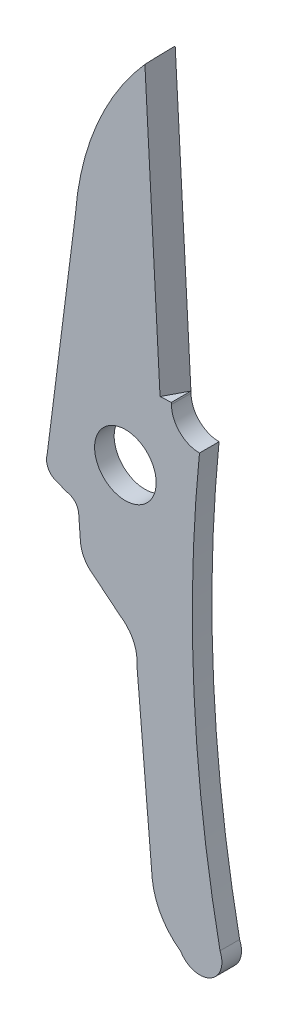
ISO-10303-21;
HEADER;
FILE_DESCRIPTION(('STEP AP214'),'2;1');
FILE_NAME('part.step','',(''),(''),'','','');
FILE_SCHEMA(('AUTOMOTIVE_DESIGN { 1 0 10303 214 1 1 1 1 }'));
ENDSEC;
DATA;
#1=APPLICATION_CONTEXT('core data for automotive mechanical design processes');
#2=APPLICATION_PROTOCOL_DEFINITION('international standard','automotive_design',2000,#1);
#3=PRODUCT_CONTEXT('',#1,'mechanical');
#4=PRODUCT('Part','Part','',(#3));
#5=PRODUCT_RELATED_PRODUCT_CATEGORY('part','',(#4));
#6=PRODUCT_DEFINITION_FORMATION('','',#4);
#7=PRODUCT_DEFINITION_CONTEXT('part definition',#1,'design');
#8=PRODUCT_DEFINITION('design','',#6,#7);
#9=PRODUCT_DEFINITION_SHAPE('','',#8);
#10=(LENGTH_UNIT() NAMED_UNIT(*) SI_UNIT(.MILLI.,.METRE.));
#11=(NAMED_UNIT(*) PLANE_ANGLE_UNIT() SI_UNIT($,.RADIAN.));
#12=(NAMED_UNIT(*) SI_UNIT($,.STERADIAN.) SOLID_ANGLE_UNIT());
#13=UNCERTAINTY_MEASURE_WITH_UNIT(LENGTH_MEASURE(1.E-05),#10,'distance_accuracy_value','');
#14=(GEOMETRIC_REPRESENTATION_CONTEXT(3) GLOBAL_UNCERTAINTY_ASSIGNED_CONTEXT((#13)) GLOBAL_UNIT_ASSIGNED_CONTEXT((#10,
#11,#12)) REPRESENTATION_CONTEXT('',''));
#15=CARTESIAN_POINT('',(0.,0.,0.));
#16=DIRECTION('',(0.,0.,1.));
#17=DIRECTION('',(1.,0.,0.));
#18=AXIS2_PLACEMENT_3D('',#15,#16,#17);
#19=CARTESIAN_POINT('',(8.87535022084032,21.3967215415515,0.4445));
#20=DIRECTION('',(-0.998541027193039,-0.0539983056425618,0.));
#21=DIRECTION('',(0.0539983056425618,-0.998541027193039,0.));
#22=AXIS2_PLACEMENT_3D('',#19,#20,#21);
#23=PLANE('',#22);
#24=DIRECTION('',(0.,0.,-0.999999999999999));
#25=VECTOR('',#24,1.);
#26=CARTESIAN_POINT('',(9.5891248490089,8.19754349486115,-0.444499999999999));
#27=LINE('',#26,#25);
#28=CARTESIAN_POINT('',(9.5891248490089,8.19754349486114,0.4445));
#29=VERTEX_POINT('',#28);
#30=CARTESIAN_POINT('',(9.5891248490089,8.19754349486115,-0.444499999999999));
#31=VERTEX_POINT('',#30);
#32=EDGE_CURVE('E352',#29,#31,#27,.T.);
#33=ORIENTED_EDGE('',*,*,#32,.F.);
#34=DIRECTION('',(-0.0539983056425619,0.998541027193039,0.));
#35=VECTOR('',#34,1.);
#36=CARTESIAN_POINT('',(8.87535022084032,21.3967215415515,0.4445));
#37=LINE('',#36,#35);
#38=CARTESIAN_POINT('',(9.59345121249939,8.11754003193003,0.4445));
#39=VERTEX_POINT('',#38);
#40=EDGE_CURVE('E199',#39,#29,#37,.T.);
#41=ORIENTED_EDGE('',*,*,#40,.F.);
#42=DIRECTION('',(0.,0.,-0.999999999999999));
#43=VECTOR('',#42,1.);
#44=CARTESIAN_POINT('',(9.59345121249939,8.11754003193003,0.4445));
#45=LINE('',#44,#43);
#46=CARTESIAN_POINT('',(9.59345121249939,8.11754003193003,-0.444499999999999));
#47=VERTEX_POINT('',#46);
#48=EDGE_CURVE('E205',#39,#47,#45,.T.);
#49=ORIENTED_EDGE('',*,*,#48,.T.);
#50=DIRECTION('',(-0.0539983056425619,0.998541027193039,0.));
#51=VECTOR('',#50,1.);
#52=CARTESIAN_POINT('',(8.87535022084032,21.3967215415515,-0.444499999999999));
#53=LINE('',#52,#51);
#54=EDGE_CURVE('E248',#47,#31,#53,.T.);
#55=ORIENTED_EDGE('',*,*,#54,.T.);
#56=EDGE_LOOP('',(#33,#41,#49,#55));
#57=FACE_BOUND('',#56,.T.);
#58=ADVANCED_FACE('F52',(#57),#23,.F.);
#59=CARTESIAN_POINT('',(17.8999944526905,12.4660316361044,0.444499999999998));
#60=DIRECTION('',(0.,0.,0.999999999999999));
#61=DIRECTION('',(0.999999999999999,0.,0.));
#62=AXIS2_PLACEMENT_3D('',#59,#60,#61);
#63=PLANE('',#62);
#64=DIRECTION('',(-0.0539983056425618,0.998541027193039,0.));
#65=VECTOR('',#64,1.);
#66=CARTESIAN_POINT('',(9.07660929848611,8.16982808749175,0.4445));
#67=LINE('',#66,#65);
#68=CARTESIAN_POINT('',(9.07660929848611,8.16982808749175,0.4445));
#69=VERTEX_POINT('',#68);
#70=CARTESIAN_POINT('',(8.38942156859265,20.8773590649342,0.4445));
#71=VERTEX_POINT('',#70);
#72=EDGE_CURVE('E356',#69,#71,#67,.T.);
#73=ORIENTED_EDGE('',*,*,#72,.T.);
#74=CARTESIAN_POINT('',(17.8999944526905,12.4660316361044,0.444499999999998));
#75=DIRECTION('',(0.,0.,0.999999999999999));
#76=DIRECTION('',(0.999999999999999,0.,0.));
#77=AXIS2_PLACEMENT_3D('',#74,#75,#76);
#78=CIRCLE('',#77,12.6965123438967);
#79=CARTESIAN_POINT('',(5.24165207504561,13.4497968260968,0.4445));
#80=VERTEX_POINT('',#79);
#81=EDGE_CURVE('E136',#71,#80,#78,.T.);
#82=ORIENTED_EDGE('',*,*,#81,.T.);
#83=DIRECTION('',(-0.126205814413959,-0.992004078826346,0.));
#84=VECTOR('',#83,1.);
#85=CARTESIAN_POINT('',(5.24165207504561,13.4497968260968,0.4445));
#86=LINE('',#85,#84);
#87=CARTESIAN_POINT('',(3.95193941346692,3.31238575085468,0.4445));
#88=VERTEX_POINT('',#87);
#89=EDGE_CURVE('E386',#80,#88,#86,.T.);
#90=ORIENTED_EDGE('',*,*,#89,.T.);
#91=CARTESIAN_POINT('',(4.60696106937597,3.12523670630922,0.4445));
#92=DIRECTION('',(0.,0.,0.999999999999999));
#93=DIRECTION('',(0.999999999999999,0.,0.));
#94=AXIS2_PLACEMENT_3D('',#91,#92,#93);
#95=CIRCLE('',#94,0.681232804982338);
#96=CARTESIAN_POINT('',(4.41981202483053,2.47021505040017,0.4445));
#97=VERTEX_POINT('',#96);
#98=EDGE_CURVE('E297',#88,#97,#95,.T.);
#99=ORIENTED_EDGE('',*,*,#98,.T.);
#100=DIRECTION('',(0.937211368547196,-0.348761882472684,0.));
#101=VECTOR('',#100,1.);
#102=CARTESIAN_POINT('',(4.41981202483053,2.47021505040017,0.4445));
#103=LINE('',#102,#101);
#104=CARTESIAN_POINT('',(4.86832905617347,2.30330964418993,0.4445));
#105=VERTEX_POINT('',#104);
#106=EDGE_CURVE('E318',#97,#105,#103,.T.);
#107=ORIENTED_EDGE('',*,*,#106,.T.);
#108=CARTESIAN_POINT('',(4.75492122023925,1.67956654655184,0.4445));
#109=DIRECTION('',(0.,0.,-0.999999999999999));
#110=DIRECTION('',(-0.999999999999999,0.,0.));
#111=AXIS2_PLACEMENT_3D('',#108,#109,#110);
#112=CIRCLE('',#111,0.633969075825059);
#113=CARTESIAN_POINT('',(5.38889029606433,1.67956654655181,0.4445));
#114=VERTEX_POINT('',#113);
#115=EDGE_CURVE('E314',#105,#114,#112,.T.);
#116=ORIENTED_EDGE('',*,*,#115,.T.);
#117=DIRECTION('',(0.0754676674730975,-0.997148249342177,0.));
#118=VECTOR('',#117,1.);
#119=CARTESIAN_POINT('',(5.38889029606433,1.67956654655181,0.4445));
#120=LINE('',#119,#118);
#121=CARTESIAN_POINT('',(5.46181354816631,0.71603745383457,0.4445));
#122=VERTEX_POINT('',#121);
#123=EDGE_CURVE('E317',#114,#122,#120,.T.);
#124=ORIENTED_EDGE('',*,*,#123,.T.);
#125=CARTESIAN_POINT('',(6.83340609101111,0.773736504708036,0.4445));
#126=DIRECTION('',(0.,0.,0.999999999999999));
#127=DIRECTION('',(0.999999999999999,0.,0.));
#128=AXIS2_PLACEMENT_3D('',#125,#126,#127);
#129=CIRCLE('',#128,1.37280562501);
#130=CARTESIAN_POINT('',(6.06544384930026,-0.364169150153394,0.4445));
#131=VERTEX_POINT('',#130);
#132=EDGE_CURVE('E322',#122,#131,#129,.T.);
#133=ORIENTED_EDGE('',*,*,#132,.T.);
#134=DIRECTION('',(0.774450200248872,-0.632634876792672,0.));
#135=VECTOR('',#134,1.);
#136=CARTESIAN_POINT('',(6.06544384930026,-0.364169150153394,0.4445));
#137=LINE('',#136,#135);
#138=CARTESIAN_POINT('',(7.25790350826133,-1.33826867157472,0.4445));
#139=VERTEX_POINT('',#138);
#140=EDGE_CURVE('E329',#131,#139,#137,.T.);
#141=ORIENTED_EDGE('',*,*,#140,.T.);
#142=CARTESIAN_POINT('',(6.33508466458808,-2.76465930276469,0.4445));
#143=DIRECTION('',(0.,0.,-0.999999999999999));
#144=DIRECTION('',(0.999999999999999,0.,0.));
#145=AXIS2_PLACEMENT_3D('',#142,#143,#144);
#146=CIRCLE('',#145,1.69887752677614);
#147=CARTESIAN_POINT('',(8.02755801292326,-2.91203235376181,0.4445));
#148=VERTEX_POINT('',#147);
#149=EDGE_CURVE('E332',#139,#148,#146,.T.);
#150=ORIENTED_EDGE('',*,*,#149,.T.);
#151=DIRECTION('',(0.0860585561033904,-0.99629008071013,0.));
#152=VECTOR('',#151,1.);
#153=CARTESIAN_POINT('',(8.02755801292326,-2.91203235376181,0.4445));
#154=LINE('',#153,#152);
#155=CARTESIAN_POINT('',(8.72184815461192,-10.949750073174,0.4445));
#156=VERTEX_POINT('',#155);
#157=EDGE_CURVE('E335',#148,#156,#154,.T.);
#158=ORIENTED_EDGE('',*,*,#157,.T.);
#159=CARTESIAN_POINT('',(11.8017984871232,-10.6294725170538,0.4445));
#160=DIRECTION('',(0.,0.,0.999999999999999));
#161=DIRECTION('',(-0.999999999999999,0.,0.));
#162=AXIS2_PLACEMENT_3D('',#159,#160,#161);
#163=CIRCLE('',#162,3.09655805107718);
#164=CARTESIAN_POINT('',(10.0143827284991,-13.1580722618756,0.4445));
#165=VERTEX_POINT('',#164);
#166=EDGE_CURVE('E178',#156,#165,#163,.T.);
#167=ORIENTED_EDGE('',*,*,#166,.T.);
#168=CARTESIAN_POINT('',(10.8801357104957,-12.651345631404,0.4445));
#169=DIRECTION('',(0.,0.,0.999999999999999));
#170=DIRECTION('',(-0.999999999999999,0.,0.));
#171=AXIS2_PLACEMENT_3D('',#168,#169,#170);
#172=CIRCLE('',#171,1.00314510608632);
#173=CARTESIAN_POINT('',(11.7971836730414,-12.2447461500275,0.4445));
#174=VERTEX_POINT('',#173);
#175=EDGE_CURVE('E170',#165,#174,#172,.T.);
#176=ORIENTED_EDGE('',*,*,#175,.T.);
#177=CARTESIAN_POINT('',(74.7934735787826,0.400508130629064,0.4445));
#178=DIRECTION('',(0.,0.,-0.999999999999999));
#179=DIRECTION('',(0.999999999999999,0.,0.));
#180=AXIS2_PLACEMENT_3D('',#177,#178,#179);
#181=CIRCLE('',#180,64.252898749478);
#182=CARTESIAN_POINT('',(10.864708621915,6.8462826225144,0.4445));
#183=VERTEX_POINT('',#182);
#184=EDGE_CURVE('E175',#174,#183,#181,.T.);
#185=ORIENTED_EDGE('',*,*,#184,.T.);
#186=CARTESIAN_POINT('',(10.864708621915,8.11754003193003,0.4445));
#187=DIRECTION('',(0.,0.,-0.999999999999999));
#188=DIRECTION('',(0.999999999999999,0.,0.));
#189=AXIS2_PLACEMENT_3D('',#186,#187,#188);
#190=CIRCLE('',#189,1.27125740941564);
#191=EDGE_CURVE('E77',#183,#39,#190,.T.);
#192=ORIENTED_EDGE('',*,*,#191,.T.);
#193=ORIENTED_EDGE('',*,*,#40,.T.);
#194=DIRECTION('',(0.998541027193039,0.0539983056425644,0.));
#195=VECTOR('',#194,1.);
#196=CARTESIAN_POINT('',(9.5891248490089,8.19754349486115,0.4445));
#197=LINE('',#196,#195);
#198=EDGE_CURVE('E68',#69,#29,#197,.T.);
#199=ORIENTED_EDGE('',*,*,#198,.F.);
#200=EDGE_LOOP('',(#73,#82,#90,#99,#107,#116,#124,#133,#141,#150,#158,#167,#176,#185,#192,#193,#199));
#201=FACE_BOUND('',#200,.T.);
#202=CARTESIAN_POINT('',(7.50395075121722,4.69075725159076,0.4445));
#203=DIRECTION('',(0.,0.,0.999999999999999));
#204=DIRECTION('',(0.999999999999999,0.,0.));
#205=AXIS2_PLACEMENT_3D('',#202,#203,#204);
#206=CIRCLE('',#205,1.397);
#207=CARTESIAN_POINT('',(8.90095075121722,4.69075725159076,0.4445));
#208=VERTEX_POINT('',#207);
#209=EDGE_CURVE('E211',#208,#208,#206,.T.);
#210=ORIENTED_EDGE('',*,*,#209,.F.);
#211=EDGE_LOOP('',(#210));
#212=FACE_BOUND('',#211,.T.);
#213=ADVANCED_FACE('F172',(#201,#212),#63,.T.);
#214=CARTESIAN_POINT('',(17.8999944526905,12.4660316361044,-0.4445));
#215=DIRECTION('',(0.,0.,0.999999999999999));
#216=DIRECTION('',(0.999999999999999,0.,0.));
#217=AXIS2_PLACEMENT_3D('',#214,#215,#216);
#218=PLANE('',#217);
#219=CARTESIAN_POINT('',(17.8999944526905,12.4660316361044,-0.4445));
#220=DIRECTION('',(0.,0.,0.999999999999999));
#221=DIRECTION('',(0.999999999999999,0.,0.));
#222=AXIS2_PLACEMENT_3D('',#219,#220,#221);
#223=CIRCLE('',#222,12.6965123438967);
#224=CARTESIAN_POINT('',(8.87535022084032,21.3967215415515,-0.444499999999999));
#225=VERTEX_POINT('',#224);
#226=CARTESIAN_POINT('',(5.24165207504561,13.4497968260968,-0.4445));
#227=VERTEX_POINT('',#226);
#228=EDGE_CURVE('E206',#225,#227,#223,.T.);
#229=ORIENTED_EDGE('',*,*,#228,.F.);
#230=DIRECTION('',(-0.0539983056425618,0.998541027193039,0.));
#231=VECTOR('',#230,1.);
#232=CARTESIAN_POINT('',(9.5891248490089,8.19754349486115,-0.444499999999999));
#233=LINE('',#232,#231);
#234=EDGE_CURVE('E367',#31,#225,#233,.T.);
#235=ORIENTED_EDGE('',*,*,#234,.F.);
#236=ORIENTED_EDGE('',*,*,#54,.F.);
#237=CARTESIAN_POINT('',(10.864708621915,8.11754003193003,-0.444499999999999));
#238=DIRECTION('',(0.,0.,-0.999999999999999));
#239=DIRECTION('',(0.999999999999999,0.,0.));
#240=AXIS2_PLACEMENT_3D('',#237,#238,#239);
#241=CIRCLE('',#240,1.27125740941564);
#242=CARTESIAN_POINT('',(10.864708621915,6.8462826225144,-0.444499999999999));
#243=VERTEX_POINT('',#242);
#244=EDGE_CURVE('E128',#243,#47,#241,.T.);
#245=ORIENTED_EDGE('',*,*,#244,.F.);
#246=CARTESIAN_POINT('',(74.7934735787826,0.400508130629064,-0.444499999999999));
#247=DIRECTION('',(0.,0.,-0.999999999999999));
#248=DIRECTION('',(0.999999999999999,0.,0.));
#249=AXIS2_PLACEMENT_3D('',#246,#247,#248);
#250=CIRCLE('',#249,64.252898749478);
#251=CARTESIAN_POINT('',(11.7971836730414,-12.2447461500275,-0.444499999999999));
#252=VERTEX_POINT('',#251);
#253=EDGE_CURVE('E243',#252,#243,#250,.T.);
#254=ORIENTED_EDGE('',*,*,#253,.F.);
#255=CARTESIAN_POINT('',(10.8801357104957,-12.651345631404,-0.444499999999999));
#256=DIRECTION('',(0.,0.,0.999999999999999));
#257=DIRECTION('',(-0.999999999999999,0.,0.));
#258=AXIS2_PLACEMENT_3D('',#255,#256,#257);
#259=CIRCLE('',#258,1.00314510608632);
#260=CARTESIAN_POINT('',(10.0143827284991,-13.1580722618756,-0.444499999999999));
#261=VERTEX_POINT('',#260);
#262=EDGE_CURVE('E188',#261,#252,#259,.T.);
#263=ORIENTED_EDGE('',*,*,#262,.F.);
#264=CARTESIAN_POINT('',(11.8017984871232,-10.6294725170538,-0.444499999999999));
#265=DIRECTION('',(0.,0.,0.999999999999999));
#266=DIRECTION('',(-0.999999999999999,0.,0.));
#267=AXIS2_PLACEMENT_3D('',#264,#265,#266);
#268=CIRCLE('',#267,3.09655805107718);
#269=CARTESIAN_POINT('',(8.72184815461192,-10.949750073174,-0.4445));
#270=VERTEX_POINT('',#269);
#271=EDGE_CURVE('E238',#270,#261,#268,.T.);
#272=ORIENTED_EDGE('',*,*,#271,.F.);
#273=DIRECTION('',(0.0860585561033904,-0.99629008071013,0.));
#274=VECTOR('',#273,1.);
#275=CARTESIAN_POINT('',(8.02755801292326,-2.91203235376181,-0.444499999999999));
#276=LINE('',#275,#274);
#277=CARTESIAN_POINT('',(8.02755801292326,-2.91203235376181,-0.444499999999999));
#278=VERTEX_POINT('',#277);
#279=EDGE_CURVE('E235',#278,#270,#276,.T.);
#280=ORIENTED_EDGE('',*,*,#279,.F.);
#281=CARTESIAN_POINT('',(6.33508466458808,-2.76465930276469,-0.4445));
#282=DIRECTION('',(0.,0.,-0.999999999999999));
#283=DIRECTION('',(0.999999999999999,0.,0.));
#284=AXIS2_PLACEMENT_3D('',#281,#282,#283);
#285=CIRCLE('',#284,1.69887752677614);
#286=CARTESIAN_POINT('',(7.25790350826133,-1.33826867157472,-0.4445));
#287=VERTEX_POINT('',#286);
#288=EDGE_CURVE('E232',#287,#278,#285,.T.);
#289=ORIENTED_EDGE('',*,*,#288,.F.);
#290=DIRECTION('',(0.774450200248872,-0.632634876792672,0.));
#291=VECTOR('',#290,1.);
#292=CARTESIAN_POINT('',(6.06544384930026,-0.364169150153394,-0.4445));
#293=LINE('',#292,#291);
#294=CARTESIAN_POINT('',(6.06544384930026,-0.364169150153394,-0.4445));
#295=VERTEX_POINT('',#294);
#296=EDGE_CURVE('E229',#295,#287,#293,.T.);
#297=ORIENTED_EDGE('',*,*,#296,.F.);
#298=CARTESIAN_POINT('',(6.83340609101111,0.773736504708036,-0.4445));
#299=DIRECTION('',(0.,0.,0.999999999999999));
#300=DIRECTION('',(0.999999999999999,0.,0.));
#301=AXIS2_PLACEMENT_3D('',#298,#299,#300);
#302=CIRCLE('',#301,1.37280562501);
#303=CARTESIAN_POINT('',(5.46181354816631,0.71603745383457,-0.4445));
#304=VERTEX_POINT('',#303);
#305=EDGE_CURVE('E226',#304,#295,#302,.T.);
#306=ORIENTED_EDGE('',*,*,#305,.F.);
#307=DIRECTION('',(0.0754676674730975,-0.997148249342177,0.));
#308=VECTOR('',#307,1.);
#309=CARTESIAN_POINT('',(5.38889029606433,1.67956654655181,-0.4445));
#310=LINE('',#309,#308);
#311=CARTESIAN_POINT('',(5.38889029606433,1.67956654655181,-0.4445));
#312=VERTEX_POINT('',#311);
#313=EDGE_CURVE('E223',#312,#304,#310,.T.);
#314=ORIENTED_EDGE('',*,*,#313,.F.);
#315=CARTESIAN_POINT('',(4.75492122023925,1.67956654655184,-0.4445));
#316=DIRECTION('',(0.,0.,-0.999999999999999));
#317=DIRECTION('',(-0.999999999999999,0.,0.));
#318=AXIS2_PLACEMENT_3D('',#315,#316,#317);
#319=CIRCLE('',#318,0.633969075825059);
#320=CARTESIAN_POINT('',(4.86832905617347,2.30330964418993,-0.4445));
#321=VERTEX_POINT('',#320);
#322=EDGE_CURVE('E220',#321,#312,#319,.T.);
#323=ORIENTED_EDGE('',*,*,#322,.F.);
#324=DIRECTION('',(0.937211368547196,-0.348761882472684,0.));
#325=VECTOR('',#324,1.);
#326=CARTESIAN_POINT('',(4.41981202483053,2.47021505040017,-0.4445));
#327=LINE('',#326,#325);
#328=CARTESIAN_POINT('',(4.41981202483053,2.47021505040017,-0.4445));
#329=VERTEX_POINT('',#328);
#330=EDGE_CURVE('E217',#329,#321,#327,.T.);
#331=ORIENTED_EDGE('',*,*,#330,.F.);
#332=CARTESIAN_POINT('',(4.60696106937597,3.12523670630922,-0.4445));
#333=DIRECTION('',(0.,0.,0.999999999999999));
#334=DIRECTION('',(0.999999999999999,0.,0.));
#335=AXIS2_PLACEMENT_3D('',#332,#333,#334);
#336=CIRCLE('',#335,0.681232804982338);
#337=CARTESIAN_POINT('',(3.95193941346692,3.31238575085468,-0.4445));
#338=VERTEX_POINT('',#337);
#339=EDGE_CURVE('E214',#338,#329,#336,.T.);
#340=ORIENTED_EDGE('',*,*,#339,.F.);
#341=DIRECTION('',(-0.126205814413959,-0.992004078826346,0.));
#342=VECTOR('',#341,1.);
#343=CARTESIAN_POINT('',(5.24165207504561,13.4497968260968,-0.4445));
#344=LINE('',#343,#342);
#345=EDGE_CURVE('E210',#227,#338,#344,.T.);
#346=ORIENTED_EDGE('',*,*,#345,.F.);
#347=EDGE_LOOP('',(#229,#235,#236,#245,#254,#263,#272,#280,#289,#297,#306,#314,#323,#331,#340,#346));
#348=FACE_BOUND('',#347,.T.);
#349=CARTESIAN_POINT('',(7.50395075121722,4.69075725159076,-0.444499999999999));
#350=DIRECTION('',(0.,0.,0.999999999999999));
#351=DIRECTION('',(0.999999999999999,0.,0.));
#352=AXIS2_PLACEMENT_3D('',#349,#350,#351);
#353=CIRCLE('',#352,1.397);
#354=CARTESIAN_POINT('',(8.90095075121722,4.69075725159076,-0.444499999999999));
#355=VERTEX_POINT('',#354);
#356=EDGE_CURVE('E377',#355,#355,#353,.T.);
#357=ORIENTED_EDGE('',*,*,#356,.T.);
#358=EDGE_LOOP('',(#357));
#359=FACE_BOUND('',#358,.T.);
#360=ADVANCED_FACE('F302',(#348,#359),#218,.F.);
#361=CARTESIAN_POINT('',(17.8999944526905,12.4660316361044,0.444499999999998));
#362=DIRECTION('',(0.,0.,-0.999999999999999));
#363=DIRECTION('',(-0.999999999999999,0.,0.));
#364=AXIS2_PLACEMENT_3D('',#361,#362,#363);
#365=CYLINDRICAL_SURFACE('',#364,12.6965123438967);
#366=ORIENTED_EDGE('',*,*,#81,.F.);
#367=CARTESIAN_POINT('',(17.8999944526905,12.4660316361044,-15.2175690594151));
#368=DIRECTION('',(-0.864761896270183,-0.0467639044477752,-0.499999999999994));
#369=DIRECTION('',(0.499270513596515,0.0269991528212807,-0.86602540378444));
#370=AXIS2_PLACEMENT_3D('',#367,#368,#369);
#371=ELLIPSE('',#370,25.3930246877937,12.6965123438967);
#372=EDGE_CURVE('E371',#71,#225,#371,.T.);
#373=ORIENTED_EDGE('',*,*,#372,.T.);
#374=ORIENTED_EDGE('',*,*,#228,.T.);
#375=DIRECTION('',(0.,0.,-0.999999999999999));
#376=VECTOR('',#375,1.);
#377=CARTESIAN_POINT('',(5.24165207504561,13.4497968260968,0.4445));
#378=LINE('',#377,#376);
#379=EDGE_CURVE('E13',#80,#227,#378,.T.);
#380=ORIENTED_EDGE('',*,*,#379,.F.);
#381=EDGE_LOOP('',(#366,#373,#374,#380));
#382=FACE_BOUND('',#381,.T.);
#383=ADVANCED_FACE('F54',(#382),#365,.T.);
#384=CARTESIAN_POINT('',(5.24165207504561,13.4497968260968,0.4445));
#385=DIRECTION('',(0.992004078826346,-0.126205814413959,0.));
#386=DIRECTION('',(0.126205814413959,0.992004078826346,0.));
#387=AXIS2_PLACEMENT_3D('',#384,#385,#386);
#388=PLANE('',#387);
#389=ORIENTED_EDGE('',*,*,#345,.T.);
#390=DIRECTION('',(0.,0.,-0.999999999999999));
#391=VECTOR('',#390,1.);
#392=CARTESIAN_POINT('',(3.95193941346692,3.31238575085468,0.4445));
#393=LINE('',#392,#391);
#394=EDGE_CURVE('E61',#88,#338,#393,.T.);
#395=ORIENTED_EDGE('',*,*,#394,.F.);
#396=ORIENTED_EDGE('',*,*,#89,.F.);
#397=ORIENTED_EDGE('',*,*,#379,.T.);
#398=EDGE_LOOP('',(#389,#395,#396,#397));
#399=FACE_BOUND('',#398,.T.);
#400=ADVANCED_FACE('F390',(#399),#388,.F.);
#401=CARTESIAN_POINT('',(4.60696106937597,3.12523670630922,0.4445));
#402=DIRECTION('',(0.,0.,-0.999999999999999));
#403=DIRECTION('',(-0.999999999999999,0.,0.));
#404=AXIS2_PLACEMENT_3D('',#401,#402,#403);
#405=CYLINDRICAL_SURFACE('',#404,0.681232804982338);
#406=ORIENTED_EDGE('',*,*,#339,.T.);
#407=DIRECTION('',(0.,0.,-0.999999999999999));
#408=VECTOR('',#407,1.);
#409=CARTESIAN_POINT('',(4.41981202483053,2.47021505040017,0.4445));
#410=LINE('',#409,#408);
#411=EDGE_CURVE('E286',#97,#329,#410,.T.);
#412=ORIENTED_EDGE('',*,*,#411,.F.);
#413=ORIENTED_EDGE('',*,*,#98,.F.);
#414=ORIENTED_EDGE('',*,*,#394,.T.);
#415=EDGE_LOOP('',(#406,#412,#413,#414));
#416=FACE_BOUND('',#415,.T.);
#417=ADVANCED_FACE('F295',(#416),#405,.T.);
#418=CARTESIAN_POINT('',(4.41981202483053,2.47021505040017,0.4445));
#419=DIRECTION('',(0.348761882472684,0.937211368547196,0.));
#420=DIRECTION('',(-0.937211368547196,0.348761882472684,0.));
#421=AXIS2_PLACEMENT_3D('',#418,#419,#420);
#422=PLANE('',#421);
#423=ORIENTED_EDGE('',*,*,#330,.T.);
#424=DIRECTION('',(0.,0.,-0.999999999999999));
#425=VECTOR('',#424,1.);
#426=CARTESIAN_POINT('',(4.86832905617347,2.30330964418993,0.4445));
#427=LINE('',#426,#425);
#428=EDGE_CURVE('E282',#105,#321,#427,.T.);
#429=ORIENTED_EDGE('',*,*,#428,.F.);
#430=ORIENTED_EDGE('',*,*,#106,.F.);
#431=ORIENTED_EDGE('',*,*,#411,.T.);
#432=EDGE_LOOP('',(#423,#429,#430,#431));
#433=FACE_BOUND('',#432,.T.);
#434=ADVANCED_FACE('F308',(#433),#422,.F.);
#435=CARTESIAN_POINT('',(4.75492122023925,1.67956654655184,0.4445));
#436=DIRECTION('',(0.,0.,-0.999999999999999));
#437=DIRECTION('',(-0.999999999999999,0.,0.));
#438=AXIS2_PLACEMENT_3D('',#435,#436,#437);
#439=CYLINDRICAL_SURFACE('',#438,0.633969075825059);
#440=ORIENTED_EDGE('',*,*,#322,.T.);
#441=DIRECTION('',(0.,0.,-0.999999999999999));
#442=VECTOR('',#441,1.);
#443=CARTESIAN_POINT('',(5.38889029606433,1.67956654655181,0.4445));
#444=LINE('',#443,#442);
#445=EDGE_CURVE('E278',#114,#312,#444,.T.);
#446=ORIENTED_EDGE('',*,*,#445,.F.);
#447=ORIENTED_EDGE('',*,*,#115,.F.);
#448=ORIENTED_EDGE('',*,*,#428,.T.);
#449=EDGE_LOOP('',(#440,#446,#447,#448));
#450=FACE_BOUND('',#449,.T.);
#451=ADVANCED_FACE('F312',(#450),#439,.F.);
#452=CARTESIAN_POINT('',(5.38889029606433,1.67956654655181,0.4445));
#453=DIRECTION('',(0.997148249342177,0.0754676674730975,0.));
#454=DIRECTION('',(-0.0754676674730975,0.997148249342177,0.));
#455=AXIS2_PLACEMENT_3D('',#452,#453,#454);
#456=PLANE('',#455);
#457=ORIENTED_EDGE('',*,*,#313,.T.);
#458=DIRECTION('',(0.,0.,-0.999999999999999));
#459=VECTOR('',#458,1.);
#460=CARTESIAN_POINT('',(5.46181354816631,0.71603745383457,0.4445));
#461=LINE('',#460,#459);
#462=EDGE_CURVE('E274',#122,#304,#461,.T.);
#463=ORIENTED_EDGE('',*,*,#462,.F.);
#464=ORIENTED_EDGE('',*,*,#123,.F.);
#465=ORIENTED_EDGE('',*,*,#445,.T.);
#466=EDGE_LOOP('',(#457,#463,#464,#465));
#467=FACE_BOUND('',#466,.T.);
#468=ADVANCED_FACE('F435',(#467),#456,.F.);
#469=CARTESIAN_POINT('',(6.83340609101111,0.773736504708036,0.4445));
#470=DIRECTION('',(0.,0.,-0.999999999999999));
#471=DIRECTION('',(-0.999999999999999,0.,0.));
#472=AXIS2_PLACEMENT_3D('',#469,#470,#471);
#473=CYLINDRICAL_SURFACE('',#472,1.37280562501);
#474=ORIENTED_EDGE('',*,*,#305,.T.);
#475=DIRECTION('',(0.,0.,-0.999999999999999));
#476=VECTOR('',#475,1.);
#477=CARTESIAN_POINT('',(6.06544384930026,-0.364169150153394,0.4445));
#478=LINE('',#477,#476);
#479=EDGE_CURVE('E270',#131,#295,#478,.T.);
#480=ORIENTED_EDGE('',*,*,#479,.F.);
#481=ORIENTED_EDGE('',*,*,#132,.F.);
#482=ORIENTED_EDGE('',*,*,#462,.T.);
#483=EDGE_LOOP('',(#474,#480,#481,#482));
#484=FACE_BOUND('',#483,.T.);
#485=ADVANCED_FACE('F431',(#484),#473,.T.);
#486=CARTESIAN_POINT('',(6.06544384930026,-0.364169150153394,0.4445));
#487=DIRECTION('',(0.632634876792673,0.774450200248872,0.));
#488=DIRECTION('',(-0.774450200248872,0.632634876792673,0.));
#489=AXIS2_PLACEMENT_3D('',#486,#487,#488);
#490=PLANE('',#489);
#491=ORIENTED_EDGE('',*,*,#296,.T.);
#492=DIRECTION('',(0.,0.,-0.999999999999999));
#493=VECTOR('',#492,1.);
#494=CARTESIAN_POINT('',(7.25790350826133,-1.33826867157472,0.4445));
#495=LINE('',#494,#493);
#496=EDGE_CURVE('E266',#139,#287,#495,.T.);
#497=ORIENTED_EDGE('',*,*,#496,.F.);
#498=ORIENTED_EDGE('',*,*,#140,.F.);
#499=ORIENTED_EDGE('',*,*,#479,.T.);
#500=EDGE_LOOP('',(#491,#497,#498,#499));
#501=FACE_BOUND('',#500,.T.);
#502=ADVANCED_FACE('F427',(#501),#490,.F.);
#503=CARTESIAN_POINT('',(6.33508466458808,-2.76465930276469,0.4445));
#504=DIRECTION('',(0.,0.,-0.999999999999999));
#505=DIRECTION('',(-0.999999999999999,0.,0.));
#506=AXIS2_PLACEMENT_3D('',#503,#504,#505);
#507=CYLINDRICAL_SURFACE('',#506,1.69887752677614);
#508=ORIENTED_EDGE('',*,*,#288,.T.);
#509=DIRECTION('',(0.,0.,-0.999999999999999));
#510=VECTOR('',#509,1.);
#511=CARTESIAN_POINT('',(8.02755801292326,-2.91203235376181,0.4445));
#512=LINE('',#511,#510);
#513=EDGE_CURVE('E262',#148,#278,#512,.T.);
#514=ORIENTED_EDGE('',*,*,#513,.F.);
#515=ORIENTED_EDGE('',*,*,#149,.F.);
#516=ORIENTED_EDGE('',*,*,#496,.T.);
#517=EDGE_LOOP('',(#508,#514,#515,#516));
#518=FACE_BOUND('',#517,.T.);
#519=ADVANCED_FACE('F424',(#518),#507,.F.);
#520=CARTESIAN_POINT('',(8.02755801292326,-2.91203235376181,0.4445));
#521=DIRECTION('',(0.99629008071013,0.0860585561033904,0.));
#522=DIRECTION('',(-0.0860585561033904,0.99629008071013,0.));
#523=AXIS2_PLACEMENT_3D('',#520,#521,#522);
#524=PLANE('',#523);
#525=ORIENTED_EDGE('',*,*,#279,.T.);
#526=DIRECTION('',(0.,0.,-0.999999999999999));
#527=VECTOR('',#526,1.);
#528=CARTESIAN_POINT('',(8.72184815461192,-10.949750073174,0.4445));
#529=LINE('',#528,#527);
#530=EDGE_CURVE('E258',#156,#270,#529,.T.);
#531=ORIENTED_EDGE('',*,*,#530,.F.);
#532=ORIENTED_EDGE('',*,*,#157,.F.);
#533=ORIENTED_EDGE('',*,*,#513,.T.);
#534=EDGE_LOOP('',(#525,#531,#532,#533));
#535=FACE_BOUND('',#534,.T.);
#536=ADVANCED_FACE('F343',(#535),#524,.F.);
#537=CARTESIAN_POINT('',(11.8017984871232,-10.6294725170538,0.4445));
#538=DIRECTION('',(0.,0.,-0.999999999999999));
#539=DIRECTION('',(-0.999999999999999,0.,0.));
#540=AXIS2_PLACEMENT_3D('',#537,#538,#539);
#541=CYLINDRICAL_SURFACE('',#540,3.09655805107718);
#542=ORIENTED_EDGE('',*,*,#271,.T.);
#543=DIRECTION('',(0.,0.,-0.999999999999999));
#544=VECTOR('',#543,1.);
#545=CARTESIAN_POINT('',(10.0143827284991,-13.1580722618756,0.4445));
#546=LINE('',#545,#544);
#547=EDGE_CURVE('E192',#165,#261,#546,.T.);
#548=ORIENTED_EDGE('',*,*,#547,.F.);
#549=ORIENTED_EDGE('',*,*,#166,.F.);
#550=ORIENTED_EDGE('',*,*,#530,.T.);
#551=EDGE_LOOP('',(#542,#548,#549,#550));
#552=FACE_BOUND('',#551,.T.);
#553=ADVANCED_FACE('F347',(#552),#541,.T.);
#554=CARTESIAN_POINT('',(10.8801357104957,-12.651345631404,0.4445));
#555=DIRECTION('',(0.,0.,-0.999999999999999));
#556=DIRECTION('',(-0.999999999999999,0.,0.));
#557=AXIS2_PLACEMENT_3D('',#554,#555,#556);
#558=CYLINDRICAL_SURFACE('',#557,1.00314510608632);
#559=ORIENTED_EDGE('',*,*,#262,.T.);
#560=DIRECTION('',(0.,0.,-0.999999999999999));
#561=VECTOR('',#560,1.);
#562=CARTESIAN_POINT('',(11.7971836730414,-12.2447461500275,0.4445));
#563=LINE('',#562,#561);
#564=EDGE_CURVE('E185',#174,#252,#563,.T.);
#565=ORIENTED_EDGE('',*,*,#564,.F.);
#566=ORIENTED_EDGE('',*,*,#175,.F.);
#567=ORIENTED_EDGE('',*,*,#547,.T.);
#568=EDGE_LOOP('',(#559,#565,#566,#567));
#569=FACE_BOUND('',#568,.T.);
#570=ADVANCED_FACE('F186',(#569),#558,.T.);
#571=CARTESIAN_POINT('',(74.7934735787826,0.400508130629064,0.4445));
#572=DIRECTION('',(0.,0.,-0.999999999999999));
#573=DIRECTION('',(-0.999999999999999,0.,0.));
#574=AXIS2_PLACEMENT_3D('',#571,#572,#573);
#575=CYLINDRICAL_SURFACE('',#574,64.252898749478);
#576=ORIENTED_EDGE('',*,*,#253,.T.);
#577=DIRECTION('',(0.,0.,-0.999999999999999));
#578=VECTOR('',#577,1.);
#579=CARTESIAN_POINT('',(10.864708621915,6.8462826225144,0.4445));
#580=LINE('',#579,#578);
#581=EDGE_CURVE('E193',#183,#243,#580,.T.);
#582=ORIENTED_EDGE('',*,*,#581,.F.);
#583=ORIENTED_EDGE('',*,*,#184,.F.);
#584=ORIENTED_EDGE('',*,*,#564,.T.);
#585=EDGE_LOOP('',(#576,#582,#583,#584));
#586=FACE_BOUND('',#585,.T.);
#587=ADVANCED_FACE('F195',(#586),#575,.F.);
#588=CARTESIAN_POINT('',(10.864708621915,8.11754003193003,0.4445));
#589=DIRECTION('',(0.,0.,-0.999999999999999));
#590=DIRECTION('',(-0.999999999999999,0.,0.));
#591=AXIS2_PLACEMENT_3D('',#588,#589,#590);
#592=CYLINDRICAL_SURFACE('',#591,1.27125740941564);
#593=ORIENTED_EDGE('',*,*,#244,.T.);
#594=ORIENTED_EDGE('',*,*,#48,.F.);
#595=ORIENTED_EDGE('',*,*,#191,.F.);
#596=ORIENTED_EDGE('',*,*,#581,.T.);
#597=EDGE_LOOP('',(#593,#594,#595,#596));
#598=FACE_BOUND('',#597,.T.);
#599=ADVANCED_FACE('F349',(#598),#592,.F.);
#600=CARTESIAN_POINT('',(7.50395075121722,4.69075725159076,0.4445));
#601=DIRECTION('',(0.,0.,-0.999999999999999));
#602=DIRECTION('',(-0.999999999999999,0.,0.));
#603=AXIS2_PLACEMENT_3D('',#600,#601,#602);
#604=CYLINDRICAL_SURFACE('',#603,1.397);
#605=ORIENTED_EDGE('',*,*,#209,.T.);
#606=EDGE_LOOP('',(#605));
#607=FACE_BOUND('',#606,.T.);
#608=ORIENTED_EDGE('',*,*,#356,.F.);
#609=EDGE_LOOP('',(#608));
#610=FACE_BOUND('',#609,.T.);
#611=ADVANCED_FACE('F404',(#607,#610),#604,.F.);
#612=CARTESIAN_POINT('',(9.07660929848611,8.16982808749175,0.4445));
#613=DIRECTION('',(-0.864761896270183,-0.0467639044477752,-0.499999999999994));
#614=DIRECTION('',(-0.500547614021187,0.,0.865709007748963));
#615=AXIS2_PLACEMENT_3D('',#612,#613,#614);
#616=PLANE('',#615);
#617=ORIENTED_EDGE('',*,*,#72,.F.);
#618=DIRECTION('',(-0.499270513596514,-0.0269991528212819,0.86602540378444));
#619=VECTOR('',#618,1.);
#620=CARTESIAN_POINT('',(9.07660929848611,8.16982808749175,0.4445));
#621=LINE('',#620,#619);
#622=EDGE_CURVE('E360',#31,#69,#621,.T.);
#623=ORIENTED_EDGE('',*,*,#622,.F.);
#624=ORIENTED_EDGE('',*,*,#234,.T.);
#625=ORIENTED_EDGE('',*,*,#372,.F.);
#626=EDGE_LOOP('',(#617,#623,#624,#625));
#627=FACE_BOUND('',#626,.T.);
#628=ADVANCED_FACE('F397',(#627),#616,.F.);
#629=CARTESIAN_POINT('',(-0.414047506426464,7.65659991464346,0.));
#630=DIRECTION('',(-0.0539983056425644,0.998541027193039,0.));
#631=DIRECTION('',(-0.998541027193039,-0.0539983056425644,0.));
#632=AXIS2_PLACEMENT_3D('',#629,#630,#631);
#633=PLANE('',#632);
#634=ORIENTED_EDGE('',*,*,#622,.T.);
#635=ORIENTED_EDGE('',*,*,#198,.T.);
#636=ORIENTED_EDGE('',*,*,#32,.T.);
#637=EDGE_LOOP('',(#634,#635,#636));
#638=FACE_BOUND('',#637,.T.);
#639=ADVANCED_FACE('F398',(#638),#633,.T.);
#640=CLOSED_SHELL('',(#58,#213,#360,#383,#400,#417,#434,#451,#468,#485,#502,#519,#536,#553,#570,
#587,#599,#611,#628,#639));
#641=MANIFOLD_SOLID_BREP('B2',#640);
#642=ADVANCED_BREP_SHAPE_REPRESENTATION('',(#18,#641),#14);
#643=SHAPE_DEFINITION_REPRESENTATION(#9,#642);
ENDSEC;
END-ISO-10303-21;
